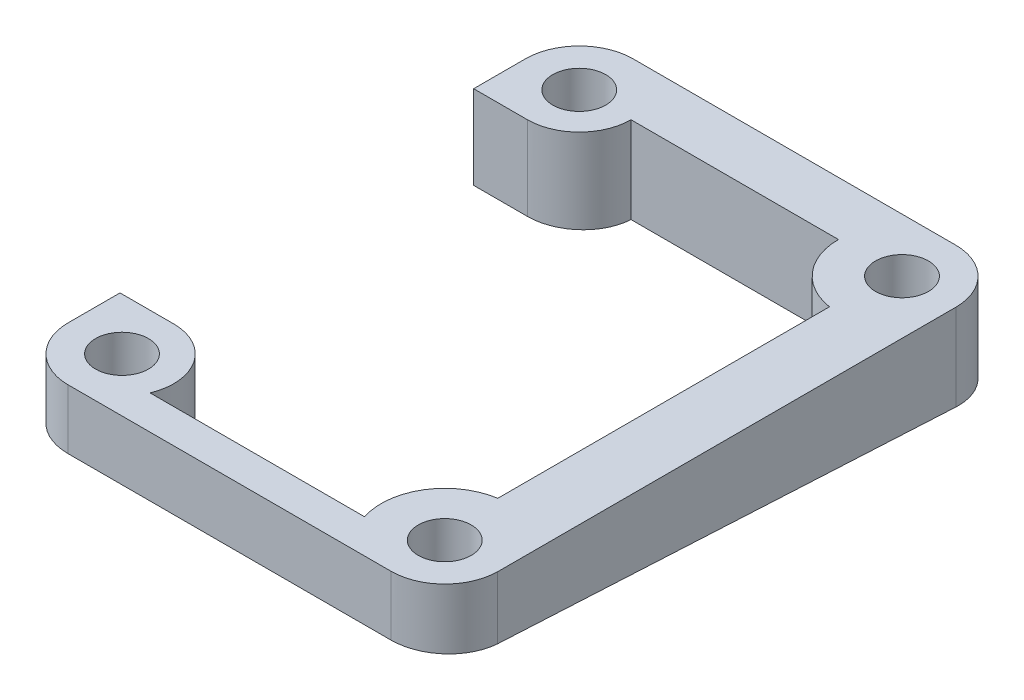
ISO-10303-21;
HEADER;
FILE_DESCRIPTION(('STEP AP214'),'2;1');
FILE_NAME('part.step','',(''),(''),'','','');
FILE_SCHEMA(('AUTOMOTIVE_DESIGN { 1 0 10303 214 1 1 1 1 }'));
ENDSEC;
DATA;
#1=APPLICATION_CONTEXT('core data for automotive mechanical design processes');
#2=APPLICATION_PROTOCOL_DEFINITION('international standard','automotive_design',2000,#1);
#3=PRODUCT_CONTEXT('',#1,'mechanical');
#4=PRODUCT('Part','Part','',(#3));
#5=PRODUCT_RELATED_PRODUCT_CATEGORY('part','',(#4));
#6=PRODUCT_DEFINITION_FORMATION('','',#4);
#7=PRODUCT_DEFINITION_CONTEXT('part definition',#1,'design');
#8=PRODUCT_DEFINITION('design','',#6,#7);
#9=PRODUCT_DEFINITION_SHAPE('','',#8);
#10=(LENGTH_UNIT() NAMED_UNIT(*) SI_UNIT(.MILLI.,.METRE.));
#11=(NAMED_UNIT(*) PLANE_ANGLE_UNIT() SI_UNIT($,.RADIAN.));
#12=(NAMED_UNIT(*) SI_UNIT($,.STERADIAN.) SOLID_ANGLE_UNIT());
#13=UNCERTAINTY_MEASURE_WITH_UNIT(LENGTH_MEASURE(1.E-05),#10,'distance_accuracy_value','');
#14=(GEOMETRIC_REPRESENTATION_CONTEXT(3) GLOBAL_UNCERTAINTY_ASSIGNED_CONTEXT((#13)) GLOBAL_UNIT_ASSIGNED_CONTEXT((#10,
#11,#12)) REPRESENTATION_CONTEXT('',''));
#15=CARTESIAN_POINT('',(0.,0.,0.));
#16=DIRECTION('',(0.,0.,1.));
#17=DIRECTION('',(1.,0.,0.));
#18=AXIS2_PLACEMENT_3D('',#15,#16,#17);
#19=CARTESIAN_POINT('',(-6326.34207077377,-2154.41168809204,-295.630515946644));
#20=DIRECTION('',(0.,1.,0.));
#21=DIRECTION('',(-1.,0.,0.));
#22=AXIS2_PLACEMENT_3D('',#19,#20,#21);
#23=CYLINDRICAL_SURFACE('',#22,1.25000000000973);
#24=CARTESIAN_POINT('',(-6326.34207077377,-2117.34312828324,-295.630515946644));
#25=DIRECTION('',(0.,-1.,0.));
#26=DIRECTION('',(1.,0.,0.));
#27=AXIS2_PLACEMENT_3D('',#24,#25,#26);
#28=CIRCLE('',#27,1.25000000000973);
#29=CARTESIAN_POINT('',(-6325.09207077376,-2117.34312828324,-295.630515946644));
#30=VERTEX_POINT('',#29);
#31=EDGE_CURVE('E195',#30,#30,#28,.T.);
#32=ORIENTED_EDGE('',*,*,#31,.F.);
#33=EDGE_LOOP('',(#32));
#34=FACE_BOUND('',#33,.T.);
#35=CARTESIAN_POINT('',(-6326.34207077377,-2120.2931522486,-295.630515946644));
#36=DIRECTION('',(0.,-0.998625843115796,0.0524063494365438));
#37=DIRECTION('',(0.,0.0524063494365438,0.998625843115796));
#38=AXIS2_PLACEMENT_3D('',#35,#36,#37);
#39=ELLIPSE('',#38,1.25172005974693,1.25000000000973);
#40=CARTESIAN_POINT('',(-6326.34207077377,-2120.22755416975,-294.380515946635));
#41=VERTEX_POINT('',#40);
#42=EDGE_CURVE('E627',#41,#41,#39,.T.);
#43=ORIENTED_EDGE('',*,*,#42,.T.);
#44=EDGE_LOOP('',(#43));
#45=FACE_BOUND('',#44,.T.);
#46=ADVANCED_FACE('F41',(#34,#45),#23,.F.);
#47=CARTESIAN_POINT('',(-6326.34207077377,-2154.41168809204,-317.220515946645));
#48=DIRECTION('',(0.,1.,0.));
#49=DIRECTION('',(-1.,0.,0.));
#50=AXIS2_PLACEMENT_3D('',#47,#48,#49);
#51=CYLINDRICAL_SURFACE('',#50,1.25000000000883);
#52=CARTESIAN_POINT('',(-6326.34207077377,-2117.34312828324,-317.220515946645));
#53=DIRECTION('',(0.,-1.,0.));
#54=DIRECTION('',(1.,0.,0.));
#55=AXIS2_PLACEMENT_3D('',#52,#53,#54);
#56=CIRCLE('',#55,1.25000000000883);
#57=CARTESIAN_POINT('',(-6325.09207077376,-2117.34312828324,-317.220515946645));
#58=VERTEX_POINT('',#57);
#59=EDGE_CURVE('E198',#58,#58,#56,.T.);
#60=ORIENTED_EDGE('',*,*,#59,.F.);
#61=EDGE_LOOP('',(#60));
#62=FACE_BOUND('',#61,.T.);
#63=CARTESIAN_POINT('',(-6326.34207077377,-2121.42616226645,-317.220515946645));
#64=DIRECTION('',(0.,-0.998625843115796,0.0524063494365438));
#65=DIRECTION('',(0.,0.0524063494365438,0.998625843115796));
#66=AXIS2_PLACEMENT_3D('',#63,#64,#65);
#67=ELLIPSE('',#66,1.25172005974603,1.25000000000883);
#68=CARTESIAN_POINT('',(-6326.34207077377,-2121.3605641876,-315.970515946636));
#69=VERTEX_POINT('',#68);
#70=EDGE_CURVE('E51',#69,#69,#67,.T.);
#71=ORIENTED_EDGE('',*,*,#70,.T.);
#72=EDGE_LOOP('',(#71));
#73=FACE_BOUND('',#72,.T.);
#74=ADVANCED_FACE('F365',(#62,#73),#51,.F.);
#75=CARTESIAN_POINT('',(-6341.58207077377,-2154.41168809204,-317.220515946644));
#76=DIRECTION('',(0.,1.,0.));
#77=DIRECTION('',(-1.,0.,0.));
#78=AXIS2_PLACEMENT_3D('',#75,#76,#77);
#79=CYLINDRICAL_SURFACE('',#78,1.25000000000891);
#80=CARTESIAN_POINT('',(-6341.58207077377,-2117.34312828324,-317.220515946644));
#81=DIRECTION('',(0.,-1.,0.));
#82=DIRECTION('',(1.,0.,0.));
#83=AXIS2_PLACEMENT_3D('',#80,#81,#82);
#84=CIRCLE('',#83,1.25000000000891);
#85=CARTESIAN_POINT('',(-6340.33207077376,-2117.34312828324,-317.220515946644));
#86=VERTEX_POINT('',#85);
#87=EDGE_CURVE('E201',#86,#86,#84,.T.);
#88=ORIENTED_EDGE('',*,*,#87,.F.);
#89=EDGE_LOOP('',(#88));
#90=FACE_BOUND('',#89,.T.);
#91=CARTESIAN_POINT('',(-6341.58207077377,-2121.42616226645,-317.220515946644));
#92=DIRECTION('',(0.,-0.998625843115796,0.0524063494365438));
#93=DIRECTION('',(0.,0.0524063494365438,0.998625843115796));
#94=AXIS2_PLACEMENT_3D('',#91,#92,#93);
#95=ELLIPSE('',#94,1.25172005974611,1.25000000000891);
#96=CARTESIAN_POINT('',(-6341.58207077377,-2121.3605641876,-315.970515946636));
#97=VERTEX_POINT('',#96);
#98=EDGE_CURVE('E11',#97,#97,#95,.T.);
#99=ORIENTED_EDGE('',*,*,#98,.T.);
#100=EDGE_LOOP('',(#99));
#101=FACE_BOUND('',#100,.T.);
#102=ADVANCED_FACE('F371',(#90,#101),#79,.F.);
#103=CARTESIAN_POINT('',(-6341.58207077376,-2154.41168809204,-295.630515946636));
#104=DIRECTION('',(0.,1.,0.));
#105=DIRECTION('',(-1.,0.,0.));
#106=AXIS2_PLACEMENT_3D('',#103,#104,#105);
#107=CYLINDRICAL_SURFACE('',#106,2.53999999999988);
#108=CARTESIAN_POINT('',(-6341.58207077376,-2120.2931522486,-295.630515946636));
#109=DIRECTION('',(0.,-0.998625843115796,0.0524063494365438));
#110=DIRECTION('',(0.,0.0524063494365438,0.998625843115796));
#111=AXIS2_PLACEMENT_3D('',#108,#109,#110);
#112=ELLIPSE('',#111,2.54349516138583,2.53999999999988);
#113=CARTESIAN_POINT('',(-6341.58207077376,-2120.15985695238,-293.090515946636));
#114=VERTEX_POINT('',#113);
#115=CARTESIAN_POINT('',(-6344.12207077376,-2120.2931522486,-295.630515946636));
#116=VERTEX_POINT('',#115);
#117=EDGE_CURVE('E107',#114,#116,#112,.T.);
#118=ORIENTED_EDGE('',*,*,#117,.F.);
#119=DIRECTION('',(0.,1.,0.));
#120=VECTOR('',#119,1.);
#121=CARTESIAN_POINT('',(-6341.58207077376,-2154.41168809204,-293.090515946636));
#122=LINE('',#121,#120);
#123=CARTESIAN_POINT('',(-6341.58207077376,-2117.34312828324,-293.090515946636));
#124=VERTEX_POINT('',#123);
#125=EDGE_CURVE('E257',#114,#124,#122,.T.);
#126=ORIENTED_EDGE('',*,*,#125,.T.);
#127=CARTESIAN_POINT('',(-6341.58207077376,-2117.34312828324,-295.630515946636));
#128=DIRECTION('',(0.,-1.,0.));
#129=DIRECTION('',(1.,0.,0.));
#130=AXIS2_PLACEMENT_3D('',#127,#128,#129);
#131=CIRCLE('',#130,2.53999999999988);
#132=CARTESIAN_POINT('',(-6344.12207077376,-2117.34312828324,-295.630515946636));
#133=VERTEX_POINT('',#132);
#134=EDGE_CURVE('E251',#124,#133,#131,.T.);
#135=ORIENTED_EDGE('',*,*,#134,.T.);
#136=DIRECTION('',(0.,1.,0.));
#137=VECTOR('',#136,1.);
#138=CARTESIAN_POINT('',(-6344.12207077376,-2154.41168809204,-295.630515946636));
#139=LINE('',#138,#137);
#140=EDGE_CURVE('E254',#116,#133,#139,.T.);
#141=ORIENTED_EDGE('',*,*,#140,.F.);
#142=EDGE_LOOP('',(#118,#126,#135,#141));
#143=FACE_BOUND('',#142,.T.);
#144=ADVANCED_FACE('F336',(#143),#107,.T.);
#145=CARTESIAN_POINT('',(-6326.34207077377,-2154.41168809204,-293.090515946645));
#146=DIRECTION('',(-5.79151774657046E-13,0.,-1.));
#147=DIRECTION('',(-1.,0.,5.79151774657046E-13));
#148=AXIS2_PLACEMENT_3D('',#145,#146,#147);
#149=PLANE('',#148);
#150=DIRECTION('',(-1.,0.,5.79151774657046E-13));
#151=VECTOR('',#150,1.);
#152=CARTESIAN_POINT('',(-6326.34207077377,-2120.15985695238,-293.090515946645));
#153=LINE('',#152,#151);
#154=CARTESIAN_POINT('',(-6326.34207077377,-2120.15985695238,-293.090515946645));
#155=VERTEX_POINT('',#154);
#156=EDGE_CURVE('E159',#155,#114,#153,.T.);
#157=ORIENTED_EDGE('',*,*,#156,.F.);
#158=DIRECTION('',(0.,1.,0.));
#159=VECTOR('',#158,1.);
#160=CARTESIAN_POINT('',(-6326.34207077377,-2154.41168809204,-293.09051594664));
#161=LINE('',#160,#159);
#162=CARTESIAN_POINT('',(-6326.34207077377,-2117.34312828324,-293.09051594664));
#163=VERTEX_POINT('',#162);
#164=EDGE_CURVE('E260',#155,#163,#161,.T.);
#165=ORIENTED_EDGE('',*,*,#164,.T.);
#166=DIRECTION('',(-1.,0.,5.79151774657046E-13));
#167=VECTOR('',#166,1.);
#168=CARTESIAN_POINT('',(-6326.34207077377,-2117.34312828324,-293.090515946645));
#169=LINE('',#168,#167);
#170=EDGE_CURVE('E248',#163,#124,#169,.T.);
#171=ORIENTED_EDGE('',*,*,#170,.T.);
#172=ORIENTED_EDGE('',*,*,#125,.F.);
#173=EDGE_LOOP('',(#157,#165,#171,#172));
#174=FACE_BOUND('',#173,.T.);
#175=ADVANCED_FACE('F387',(#174),#149,.F.);
#176=CARTESIAN_POINT('',(-6326.34207077376,-2154.41168809204,-295.630515946636));
#177=DIRECTION('',(0.,1.,0.));
#178=DIRECTION('',(-1.,0.,0.));
#179=AXIS2_PLACEMENT_3D('',#176,#177,#178);
#180=CYLINDRICAL_SURFACE('',#179,2.53999999999558);
#181=CARTESIAN_POINT('',(-6326.34207077376,-2120.2931522486,-295.630515946636));
#182=DIRECTION('',(0.,-0.998625843115796,0.0524063494365438));
#183=DIRECTION('',(0.,0.0524063494365438,0.998625843115796));
#184=AXIS2_PLACEMENT_3D('',#181,#182,#183);
#185=ELLIPSE('',#184,2.54349516138153,2.53999999999558);
#186=CARTESIAN_POINT('',(-6323.80274025592,-2120.29009202015,-295.572201958867));
#187=VERTEX_POINT('',#186);
#188=EDGE_CURVE('E102',#187,#155,#185,.T.);
#189=ORIENTED_EDGE('',*,*,#188,.F.);
#190=DIRECTION('',(0.,1.,0.));
#191=VECTOR('',#190,1.);
#192=CARTESIAN_POINT('',(-6323.80274025592,-2154.41168809204,-295.572201958867));
#193=LINE('',#192,#191);
#194=CARTESIAN_POINT('',(-6323.80274025592,-2117.34312828324,-295.572201958867));
#195=VERTEX_POINT('',#194);
#196=EDGE_CURVE('E263',#187,#195,#193,.T.);
#197=ORIENTED_EDGE('',*,*,#196,.T.);
#198=CARTESIAN_POINT('',(-6326.34207077376,-2117.34312828324,-295.630515946636));
#199=DIRECTION('',(0.,-1.,0.));
#200=DIRECTION('',(1.,0.,0.));
#201=AXIS2_PLACEMENT_3D('',#198,#199,#200);
#202=CIRCLE('',#201,2.53999999999558);
#203=EDGE_CURVE('E245',#195,#163,#202,.T.);
#204=ORIENTED_EDGE('',*,*,#203,.T.);
#205=ORIENTED_EDGE('',*,*,#164,.F.);
#206=EDGE_LOOP('',(#189,#197,#204,#205));
#207=FACE_BOUND('',#206,.T.);
#208=ADVANCED_FACE('F390',(#207),#180,.T.);
#209=CARTESIAN_POINT('',(-6323.80207077498,-2154.41168809204,-317.220437396049));
#210=DIRECTION('',(-0.999999999521809,0.,-3.09254279393959E-05));
#211=DIRECTION('',(-3.09254279393959E-05,0.,0.999999999521809));
#212=AXIS2_PLACEMENT_3D('',#209,#210,#211);
#213=PLANE('',#212);
#214=DIRECTION('',(-3.08829315497958E-05,0.0524063494115524,0.998625842639574));
#215=VECTOR('',#214,1.);
#216=CARTESIAN_POINT('',(-6323.80201738916,-2121.51675044345,-318.946713165238));
#217=LINE('',#216,#215);
#218=CARTESIAN_POINT('',(-6323.80207077498,-2121.42615814424,-317.220437396049));
#219=VERTEX_POINT('',#218);
#220=EDGE_CURVE('E98',#219,#187,#217,.T.);
#221=ORIENTED_EDGE('',*,*,#220,.F.);
#222=DIRECTION('',(0.,1.,0.));
#223=VECTOR('',#222,1.);
#224=CARTESIAN_POINT('',(-6323.80207077498,-2154.41168809204,-317.220437396049));
#225=LINE('',#224,#223);
#226=CARTESIAN_POINT('',(-6323.80207077498,-2117.34312828324,-317.220437396049));
#227=VERTEX_POINT('',#226);
#228=EDGE_CURVE('E266',#219,#227,#225,.T.);
#229=ORIENTED_EDGE('',*,*,#228,.T.);
#230=DIRECTION('',(-3.09254279393959E-05,0.,0.999999999521809));
#231=VECTOR('',#230,1.);
#232=CARTESIAN_POINT('',(-6323.80207077498,-2117.34312828324,-317.220437396049));
#233=LINE('',#232,#231);
#234=EDGE_CURVE('E242',#227,#195,#233,.T.);
#235=ORIENTED_EDGE('',*,*,#234,.T.);
#236=ORIENTED_EDGE('',*,*,#196,.F.);
#237=EDGE_LOOP('',(#221,#229,#235,#236));
#238=FACE_BOUND('',#237,.T.);
#239=ADVANCED_FACE('F394',(#238),#213,.F.);
#240=CARTESIAN_POINT('',(-6326.34207077376,-2154.41168809204,-317.220515946636));
#241=DIRECTION('',(0.,1.,0.));
#242=DIRECTION('',(-1.,0.,0.));
#243=AXIS2_PLACEMENT_3D('',#240,#241,#242);
#244=CYLINDRICAL_SURFACE('',#243,2.53999999999969);
#245=CARTESIAN_POINT('',(-6326.34207077376,-2121.42616226645,-317.220515946636));
#246=DIRECTION('',(0.,-0.998625843115796,0.0524063494365438));
#247=DIRECTION('',(0.,0.0524063494365438,0.998625843115796));
#248=AXIS2_PLACEMENT_3D('',#245,#246,#247);
#249=ELLIPSE('',#248,2.54349516138565,2.53999999999969);
#250=CARTESIAN_POINT('',(-6326.34207077376,-2121.55945756267,-319.760515946636));
#251=VERTEX_POINT('',#250);
#252=EDGE_CURVE('E171',#251,#219,#249,.T.);
#253=ORIENTED_EDGE('',*,*,#252,.F.);
#254=DIRECTION('',(0.,1.,0.));
#255=VECTOR('',#254,1.);
#256=CARTESIAN_POINT('',(-6326.34207077376,-2154.41168809204,-319.760515946636));
#257=LINE('',#256,#255);
#258=CARTESIAN_POINT('',(-6326.34207077376,-2117.34312828324,-319.760515946636));
#259=VERTEX_POINT('',#258);
#260=EDGE_CURVE('E269',#251,#259,#257,.T.);
#261=ORIENTED_EDGE('',*,*,#260,.T.);
#262=CARTESIAN_POINT('',(-6326.34207077376,-2117.34312828324,-317.220515946636));
#263=DIRECTION('',(0.,-1.,0.));
#264=DIRECTION('',(1.,0.,0.));
#265=AXIS2_PLACEMENT_3D('',#262,#263,#264);
#266=CIRCLE('',#265,2.53999999999969);
#267=EDGE_CURVE('E239',#259,#227,#266,.T.);
#268=ORIENTED_EDGE('',*,*,#267,.T.);
#269=ORIENTED_EDGE('',*,*,#228,.F.);
#270=EDGE_LOOP('',(#253,#261,#268,#269));
#271=FACE_BOUND('',#270,.T.);
#272=ADVANCED_FACE('F398',(#271),#244,.T.);
#273=CARTESIAN_POINT('',(-6341.58207077376,-2154.41168809204,-319.760515946636));
#274=DIRECTION('',(0.,0.,1.));
#275=DIRECTION('',(1.,0.,0.));
#276=AXIS2_PLACEMENT_3D('',#273,#274,#275);
#277=PLANE('',#276);
#278=DIRECTION('',(1.,0.,0.));
#279=VECTOR('',#278,1.);
#280=CARTESIAN_POINT('',(-6341.58207077376,-2121.55945756267,-319.760515946636));
#281=LINE('',#280,#279);
#282=CARTESIAN_POINT('',(-6341.58207077376,-2121.55945756267,-319.760515946636));
#283=VERTEX_POINT('',#282);
#284=EDGE_CURVE('E173',#283,#251,#281,.T.);
#285=ORIENTED_EDGE('',*,*,#284,.F.);
#286=DIRECTION('',(0.,1.,0.));
#287=VECTOR('',#286,1.);
#288=CARTESIAN_POINT('',(-6341.58207077376,-2154.41168809204,-319.760515946639));
#289=LINE('',#288,#287);
#290=CARTESIAN_POINT('',(-6341.58207077376,-2117.34312828324,-319.760515946639));
#291=VERTEX_POINT('',#290);
#292=EDGE_CURVE('E272',#283,#291,#289,.T.);
#293=ORIENTED_EDGE('',*,*,#292,.T.);
#294=DIRECTION('',(1.,0.,0.));
#295=VECTOR('',#294,1.);
#296=CARTESIAN_POINT('',(-6341.58207077376,-2117.34312828324,-319.760515946636));
#297=LINE('',#296,#295);
#298=EDGE_CURVE('E236',#291,#259,#297,.T.);
#299=ORIENTED_EDGE('',*,*,#298,.T.);
#300=ORIENTED_EDGE('',*,*,#260,.F.);
#301=EDGE_LOOP('',(#285,#293,#299,#300));
#302=FACE_BOUND('',#301,.T.);
#303=ADVANCED_FACE('F402',(#302),#277,.F.);
#304=CARTESIAN_POINT('',(-6341.58207077376,-2154.41168809204,-317.220515946636));
#305=DIRECTION('',(0.,1.,0.));
#306=DIRECTION('',(-1.,0.,0.));
#307=AXIS2_PLACEMENT_3D('',#304,#305,#306);
#308=CYLINDRICAL_SURFACE('',#307,2.54000000000343);
#309=CARTESIAN_POINT('',(-6341.58207077376,-2121.42616226645,-317.220515946636));
#310=DIRECTION('',(0.,-0.998625843115796,0.0524063494365438));
#311=DIRECTION('',(0.,0.0524063494365438,0.998625843115796));
#312=AXIS2_PLACEMENT_3D('',#309,#310,#311);
#313=ELLIPSE('',#312,2.54349516138939,2.54000000000343);
#314=CARTESIAN_POINT('',(-6344.12207077377,-2121.42616226645,-317.220515946644));
#315=VERTEX_POINT('',#314);
#316=EDGE_CURVE('E175',#315,#283,#313,.T.);
#317=ORIENTED_EDGE('',*,*,#316,.F.);
#318=DIRECTION('',(0.,1.,0.));
#319=VECTOR('',#318,1.);
#320=CARTESIAN_POINT('',(-6344.12207077377,-2154.41168809204,-317.220515946644));
#321=LINE('',#320,#319);
#322=CARTESIAN_POINT('',(-6344.12207077377,-2117.34312828324,-317.220515946644));
#323=VERTEX_POINT('',#322);
#324=EDGE_CURVE('E275',#315,#323,#321,.T.);
#325=ORIENTED_EDGE('',*,*,#324,.T.);
#326=CARTESIAN_POINT('',(-6341.58207077376,-2117.34312828324,-317.220515946636));
#327=DIRECTION('',(0.,-1.,0.));
#328=DIRECTION('',(1.,0.,0.));
#329=AXIS2_PLACEMENT_3D('',#326,#327,#328);
#330=CIRCLE('',#329,2.54000000000343);
#331=EDGE_CURVE('E233',#323,#291,#330,.T.);
#332=ORIENTED_EDGE('',*,*,#331,.T.);
#333=ORIENTED_EDGE('',*,*,#292,.F.);
#334=EDGE_LOOP('',(#317,#325,#332,#333));
#335=FACE_BOUND('',#334,.T.);
#336=ADVANCED_FACE('F406',(#335),#308,.T.);
#337=CARTESIAN_POINT('',(-6344.12207077377,-2154.41168809204,-317.220515946644));
#338=DIRECTION('',(1.,0.,-2.90610525872351E-12));
#339=DIRECTION('',(-2.90610525872351E-12,0.,-1.));
#340=AXIS2_PLACEMENT_3D('',#337,#338,#339);
#341=PLANE('',#340);
#342=DIRECTION('',(-2.90205266633982E-12,-0.0524063494365438,-0.998625843115796));
#343=VECTOR('',#342,1.);
#344=CARTESIAN_POINT('',(-6344.12207077377,-2121.51675455443,-318.946791501746));
#345=LINE('',#344,#343);
#346=CARTESIAN_POINT('',(-6344.12207077376,-2121.29785242423,-314.775515946637));
#347=VERTEX_POINT('',#346);
#348=EDGE_CURVE('E177',#347,#315,#345,.T.);
#349=ORIENTED_EDGE('',*,*,#348,.F.);
#350=DIRECTION('',(0.,1.,0.));
#351=VECTOR('',#350,1.);
#352=CARTESIAN_POINT('',(-6344.12207077376,-2154.41168809204,-314.775515946637));
#353=LINE('',#352,#351);
#354=CARTESIAN_POINT('',(-6344.12207077376,-2117.34312828324,-314.775515946637));
#355=VERTEX_POINT('',#354);
#356=EDGE_CURVE('E278',#347,#355,#353,.T.);
#357=ORIENTED_EDGE('',*,*,#356,.T.);
#358=DIRECTION('',(-2.90610525872351E-12,0.,-1.));
#359=VECTOR('',#358,1.);
#360=CARTESIAN_POINT('',(-6344.12207077377,-2117.34312828324,-317.220515946644));
#361=LINE('',#360,#359);
#362=EDGE_CURVE('E230',#355,#323,#361,.T.);
#363=ORIENTED_EDGE('',*,*,#362,.T.);
#364=ORIENTED_EDGE('',*,*,#324,.F.);
#365=EDGE_LOOP('',(#349,#357,#363,#364));
#366=FACE_BOUND('',#365,.T.);
#367=ADVANCED_FACE('F410',(#366),#341,.F.);
#368=CARTESIAN_POINT('',(-6341.58207077376,-2154.41168809204,-314.775515946637));
#369=DIRECTION('',(0.,0.,-1.));
#370=DIRECTION('',(-1.,0.,0.));
#371=AXIS2_PLACEMENT_3D('',#368,#369,#370);
#372=PLANE('',#371);
#373=DIRECTION('',(-1.,0.,0.));
#374=VECTOR('',#373,1.);
#375=CARTESIAN_POINT('',(-6341.58207077376,-2121.29785242423,-314.775515946637));
#376=LINE('',#375,#374);
#377=CARTESIAN_POINT('',(-6341.58207077376,-2121.29785242423,-314.775515946637));
#378=VERTEX_POINT('',#377);
#379=EDGE_CURVE('E179',#378,#347,#376,.T.);
#380=ORIENTED_EDGE('',*,*,#379,.F.);
#381=DIRECTION('',(0.,1.,0.));
#382=VECTOR('',#381,1.);
#383=CARTESIAN_POINT('',(-6341.58207077376,-2154.41168809204,-314.775515946637));
#384=LINE('',#383,#382);
#385=CARTESIAN_POINT('',(-6341.58207077376,-2117.34312828324,-314.775515946637));
#386=VERTEX_POINT('',#385);
#387=EDGE_CURVE('E281',#378,#386,#384,.T.);
#388=ORIENTED_EDGE('',*,*,#387,.T.);
#389=DIRECTION('',(-1.,0.,0.));
#390=VECTOR('',#389,1.);
#391=CARTESIAN_POINT('',(-6341.58207077376,-2117.34312828324,-314.775515946637));
#392=LINE('',#391,#390);
#393=EDGE_CURVE('E227',#386,#355,#392,.T.);
#394=ORIENTED_EDGE('',*,*,#393,.T.);
#395=ORIENTED_EDGE('',*,*,#356,.F.);
#396=EDGE_LOOP('',(#380,#388,#394,#395));
#397=FACE_BOUND('',#396,.T.);
#398=ADVANCED_FACE('F414',(#397),#372,.F.);
#399=CARTESIAN_POINT('',(-6341.58207077376,-2154.41168809204,-317.220515946636));
#400=DIRECTION('',(0.,1.,0.));
#401=DIRECTION('',(-1.,0.,0.));
#402=AXIS2_PLACEMENT_3D('',#399,#400,#401);
#403=CYLINDRICAL_SURFACE('',#402,2.44499999999903);
#404=CARTESIAN_POINT('',(-6341.58207077376,-2121.42616226645,-317.220515946636));
#405=DIRECTION('',(0.,-0.998625843115796,0.0524063494365438));
#406=DIRECTION('',(0.,0.0524063494365438,0.998625843115796));
#407=AXIS2_PLACEMENT_3D('',#404,#405,#406);
#408=ELLIPSE('',#407,2.44836443684496,2.44499999999903);
#409=CARTESIAN_POINT('',(-6339.13707077493,-2121.42615829842,-317.220440333965));
#410=VERTEX_POINT('',#409);
#411=EDGE_CURVE('E181',#410,#378,#408,.T.);
#412=ORIENTED_EDGE('',*,*,#411,.F.);
#413=DIRECTION('',(0.,1.,0.));
#414=VECTOR('',#413,1.);
#415=CARTESIAN_POINT('',(-6339.13707077493,-2154.41168809204,-317.220440333965));
#416=LINE('',#415,#414);
#417=CARTESIAN_POINT('',(-6339.13707077493,-2117.34312828324,-317.220440333965));
#418=VERTEX_POINT('',#417);
#419=EDGE_CURVE('E284',#410,#418,#416,.T.);
#420=ORIENTED_EDGE('',*,*,#419,.T.);
#421=CARTESIAN_POINT('',(-6341.58207077376,-2117.34312828324,-317.220515946636));
#422=DIRECTION('',(0.,-1.,0.));
#423=DIRECTION('',(1.,0.,0.));
#424=AXIS2_PLACEMENT_3D('',#421,#422,#423);
#425=CIRCLE('',#424,2.44499999999903);
#426=EDGE_CURVE('E224',#418,#386,#425,.T.);
#427=ORIENTED_EDGE('',*,*,#426,.T.);
#428=ORIENTED_EDGE('',*,*,#387,.F.);
#429=EDGE_LOOP('',(#412,#420,#427,#428));
#430=FACE_BOUND('',#429,.T.);
#431=ADVANCED_FACE('F312',(#430),#403,.T.);
#432=CARTESIAN_POINT('',(-6329.34207074988,-2154.41168809204,-317.220137419397));
#433=DIRECTION('',(3.09254279007452E-05,0.,-0.999999999521809));
#434=DIRECTION('',(-0.999999999521809,0.,-3.09254279007452E-05));
#435=AXIS2_PLACEMENT_3D('',#432,#433,#434);
#436=PLANE('',#435);
#437=DIRECTION('',(-0.999999999520492,-1.62291892740533E-06,-3.09254279007045E-05));
#438=VECTOR('',#437,1.);
#439=CARTESIAN_POINT('',(-6329.34212428275,-2121.42614240201,-317.220137421053));
#440=LINE('',#439,#438);
#441=CARTESIAN_POINT('',(-6329.34207074988,-2121.42614240192,-317.220137419397));
#442=VERTEX_POINT('',#441);
#443=EDGE_CURVE('E183',#442,#410,#440,.T.);
#444=ORIENTED_EDGE('',*,*,#443,.F.);
#445=DIRECTION('',(0.,1.,0.));
#446=VECTOR('',#445,1.);
#447=CARTESIAN_POINT('',(-6329.34207074988,-2154.41168809204,-317.220137419397));
#448=LINE('',#447,#446);
#449=CARTESIAN_POINT('',(-6329.34207074988,-2117.34312828324,-317.220137419397));
#450=VERTEX_POINT('',#449);
#451=EDGE_CURVE('E149',#442,#450,#448,.T.);
#452=ORIENTED_EDGE('',*,*,#451,.T.);
#453=DIRECTION('',(-0.999999999521809,0.,-3.09254279007452E-05));
#454=VECTOR('',#453,1.);
#455=CARTESIAN_POINT('',(-6329.34207074988,-2117.34312828324,-317.220137419397));
#456=LINE('',#455,#454);
#457=EDGE_CURVE('E221',#450,#418,#456,.T.);
#458=ORIENTED_EDGE('',*,*,#457,.T.);
#459=ORIENTED_EDGE('',*,*,#419,.F.);
#460=EDGE_LOOP('',(#444,#452,#458,#459));
#461=FACE_BOUND('',#460,.T.);
#462=ADVANCED_FACE('F291',(#461),#436,.F.);
#463=CARTESIAN_POINT('',(-6326.34207077376,-2154.41168809204,-317.220515946636));
#464=DIRECTION('',(0.,1.,0.));
#465=DIRECTION('',(-1.,0.,0.));
#466=AXIS2_PLACEMENT_3D('',#463,#464,#465);
#467=CYLINDRICAL_SURFACE('',#466,3.00000000000007);
#468=CARTESIAN_POINT('',(-6326.34207077376,-2121.42616226645,-317.220515946636));
#469=DIRECTION('',(0.,-0.998625843115796,0.0524063494365438));
#470=DIRECTION('',(0.,0.0524063494365438,0.998625843115796));
#471=AXIS2_PLACEMENT_3D('',#468,#469,#470);
#472=ELLIPSE('',#471,3.00412814336931,3.00000000000007);
#473=CARTESIAN_POINT('',(-6326.8021624527,-2121.27058937233,-314.256006603259));
#474=VERTEX_POINT('',#473);
#475=EDGE_CURVE('E139',#474,#442,#472,.T.);
#476=ORIENTED_EDGE('',*,*,#475,.F.);
#477=DIRECTION('',(0.,1.,0.));
#478=VECTOR('',#477,1.);
#479=CARTESIAN_POINT('',(-6326.8021624527,-2154.41168809204,-314.256006603259));
#480=LINE('',#479,#478);
#481=CARTESIAN_POINT('',(-6326.8021624527,-2117.34312828324,-314.256006603259));
#482=VERTEX_POINT('',#481);
#483=EDGE_CURVE('E138',#474,#482,#480,.T.);
#484=ORIENTED_EDGE('',*,*,#483,.T.);
#485=CARTESIAN_POINT('',(-6326.34207077376,-2117.34312828324,-317.220515946636));
#486=DIRECTION('',(0.,-1.,0.));
#487=DIRECTION('',(1.,0.,0.));
#488=AXIS2_PLACEMENT_3D('',#485,#486,#487);
#489=CIRCLE('',#488,3.00000000000007);
#490=EDGE_CURVE('E218',#482,#450,#489,.T.);
#491=ORIENTED_EDGE('',*,*,#490,.T.);
#492=ORIENTED_EDGE('',*,*,#451,.F.);
#493=EDGE_LOOP('',(#476,#484,#491,#492));
#494=FACE_BOUND('',#493,.T.);
#495=ADVANCED_FACE('F300',(#494),#467,.T.);
#496=CARTESIAN_POINT('',(-6326.80264677758,-2154.41168809204,-298.594950082303));
#497=DIRECTION('',(0.999999999521809,0.,3.09254278948737E-05));
#498=DIRECTION('',(3.09254278948737E-05,0.,-0.999999999521809));
#499=AXIS2_PLACEMENT_3D('',#496,#497,#498);
#500=PLANE('',#499);
#501=DIRECTION('',(3.08829315053348E-05,-0.0524063494115524,-0.998625842639574));
#502=VECTOR('',#501,1.);
#503=CARTESIAN_POINT('',(-6326.80259180982,-2120.54199795287,-300.37237936403));
#504=LINE('',#503,#502);
#505=CARTESIAN_POINT('',(-6326.80264677758,-2120.44872119594,-298.594950082305));
#506=VERTEX_POINT('',#505);
#507=EDGE_CURVE('E122',#506,#474,#504,.T.);
#508=ORIENTED_EDGE('',*,*,#507,.F.);
#509=DIRECTION('',(0.,1.,0.));
#510=VECTOR('',#509,1.);
#511=CARTESIAN_POINT('',(-6326.80264677758,-2154.41168809204,-298.594950082305));
#512=LINE('',#511,#510);
#513=CARTESIAN_POINT('',(-6326.80264677758,-2117.34312828324,-298.594950082305));
#514=VERTEX_POINT('',#513);
#515=EDGE_CURVE('E135',#506,#514,#512,.T.);
#516=ORIENTED_EDGE('',*,*,#515,.T.);
#517=DIRECTION('',(3.09254278948737E-05,0.,-0.999999999521809));
#518=VECTOR('',#517,1.);
#519=CARTESIAN_POINT('',(-6326.80264677758,-2117.34312828324,-298.594950082303));
#520=LINE('',#519,#518);
#521=EDGE_CURVE('E216',#514,#482,#520,.T.);
#522=ORIENTED_EDGE('',*,*,#521,.T.);
#523=ORIENTED_EDGE('',*,*,#483,.F.);
#524=EDGE_LOOP('',(#508,#516,#522,#523));
#525=FACE_BOUND('',#524,.T.);
#526=ADVANCED_FACE('F132',(#525),#500,.F.);
#527=CARTESIAN_POINT('',(-6326.34207077376,-2154.41168809204,-295.630515946636));
#528=DIRECTION('',(0.,1.,0.));
#529=DIRECTION('',(-1.,0.,0.));
#530=AXIS2_PLACEMENT_3D('',#527,#528,#529);
#531=CYLINDRICAL_SURFACE('',#530,3.00000000000175);
#532=CARTESIAN_POINT('',(-6326.34207077376,-2120.2931522486,-295.630515946636));
#533=DIRECTION('',(0.,-0.998625843115796,0.0524063494365438));
#534=DIRECTION('',(0.,0.0524063494365438,0.998625843115796));
#535=AXIS2_PLACEMENT_3D('',#532,#533,#534);
#536=ELLIPSE('',#535,3.00412814337099,3.00000000000175);
#537=CARTESIAN_POINT('',(-6329.19244757946,-2120.24405326658,-294.694913431928));
#538=VERTEX_POINT('',#537);
#539=EDGE_CURVE('E119',#538,#506,#536,.T.);
#540=ORIENTED_EDGE('',*,*,#539,.F.);
#541=DIRECTION('',(0.,1.,0.));
#542=VECTOR('',#541,1.);
#543=CARTESIAN_POINT('',(-6329.19244757946,-2154.41168809204,-294.694913431928));
#544=LINE('',#543,#542);
#545=CARTESIAN_POINT('',(-6329.19244757946,-2117.34312828324,-294.694913431928));
#546=VERTEX_POINT('',#545);
#547=EDGE_CURVE('E145',#538,#546,#544,.T.);
#548=ORIENTED_EDGE('',*,*,#547,.T.);
#549=CARTESIAN_POINT('',(-6326.34207077376,-2117.34312828324,-295.630515946636));
#550=DIRECTION('',(0.,-1.,0.));
#551=DIRECTION('',(1.,0.,0.));
#552=AXIS2_PLACEMENT_3D('',#549,#550,#551);
#553=CIRCLE('',#552,3.00000000000175);
#554=EDGE_CURVE('E143',#546,#514,#553,.T.);
#555=ORIENTED_EDGE('',*,*,#554,.T.);
#556=ORIENTED_EDGE('',*,*,#515,.F.);
#557=EDGE_LOOP('',(#540,#548,#555,#556));
#558=FACE_BOUND('',#557,.T.);
#559=ADVANCED_FACE('F141',(#558),#531,.T.);
#560=CARTESIAN_POINT('',(-6339.32316109553,-2154.41168809204,-294.694913431928));
#561=DIRECTION('',(0.,0.,1.));
#562=DIRECTION('',(0.,-1.,0.));
#563=AXIS2_PLACEMENT_3D('',#560,#561,#562);
#564=PLANE('',#563);
#565=DIRECTION('',(1.,0.,0.));
#566=VECTOR('',#565,1.);
#567=CARTESIAN_POINT('',(-6339.32316109553,-2120.24405326658,-294.694913431928));
#568=LINE('',#567,#566);
#569=CARTESIAN_POINT('',(-6339.32316109552,-2120.24405326658,-294.694913431928));
#570=VERTEX_POINT('',#569);
#571=EDGE_CURVE('E117',#570,#538,#568,.T.);
#572=ORIENTED_EDGE('',*,*,#571,.F.);
#573=DIRECTION('',(0.,1.,0.));
#574=VECTOR('',#573,1.);
#575=CARTESIAN_POINT('',(-6339.32316109552,-2154.41168809204,-294.694913431924));
#576=LINE('',#575,#574);
#577=CARTESIAN_POINT('',(-6339.32316109552,-2117.34312828324,-294.694913431924));
#578=VERTEX_POINT('',#577);
#579=EDGE_CURVE('E147',#570,#578,#576,.T.);
#580=ORIENTED_EDGE('',*,*,#579,.T.);
#581=DIRECTION('',(1.,0.,0.));
#582=VECTOR('',#581,1.);
#583=CARTESIAN_POINT('',(-6339.32316109553,-2117.34312828324,-294.694913431928));
#584=LINE('',#583,#582);
#585=EDGE_CURVE('E212',#578,#546,#584,.T.);
#586=ORIENTED_EDGE('',*,*,#585,.T.);
#587=ORIENTED_EDGE('',*,*,#547,.F.);
#588=EDGE_LOOP('',(#572,#580,#586,#587));
#589=FACE_BOUND('',#588,.T.);
#590=ADVANCED_FACE('F354',(#589),#564,.F.);
#591=CARTESIAN_POINT('',(-6341.58207077376,-2154.41168809204,-295.630515946636));
#592=DIRECTION('',(0.,1.,0.));
#593=DIRECTION('',(-1.,0.,0.));
#594=AXIS2_PLACEMENT_3D('',#591,#592,#593);
#595=CYLINDRICAL_SURFACE('',#594,2.44499999999887);
#596=CARTESIAN_POINT('',(-6341.58207077376,-2120.2931522486,-295.630515946636));
#597=DIRECTION('',(0.,-0.998625843115796,0.0524063494365438));
#598=DIRECTION('',(0.,0.0524063494365438,0.998625843115796));
#599=AXIS2_PLACEMENT_3D('',#596,#597,#598);
#600=ELLIPSE('',#599,2.4483644368448,2.44499999999887);
#601=CARTESIAN_POINT('',(-6341.58207077377,-2120.42146209083,-298.075515946644));
#602=VERTEX_POINT('',#601);
#603=EDGE_CURVE('E187',#602,#570,#600,.T.);
#604=ORIENTED_EDGE('',*,*,#603,.F.);
#605=DIRECTION('',(0.,1.,0.));
#606=VECTOR('',#605,1.);
#607=CARTESIAN_POINT('',(-6341.58207077377,-2154.41168809204,-298.075515946644));
#608=LINE('',#607,#606);
#609=CARTESIAN_POINT('',(-6341.58207077377,-2117.34312828324,-298.075515946644));
#610=VERTEX_POINT('',#609);
#611=EDGE_CURVE('E155',#602,#610,#608,.T.);
#612=ORIENTED_EDGE('',*,*,#611,.T.);
#613=CARTESIAN_POINT('',(-6341.58207077376,-2117.34312828324,-295.630515946636));
#614=DIRECTION('',(0.,-1.,0.));
#615=DIRECTION('',(1.,0.,0.));
#616=AXIS2_PLACEMENT_3D('',#613,#614,#615);
#617=CIRCLE('',#616,2.44499999999887);
#618=EDGE_CURVE('E209',#610,#578,#617,.T.);
#619=ORIENTED_EDGE('',*,*,#618,.T.);
#620=ORIENTED_EDGE('',*,*,#579,.F.);
#621=EDGE_LOOP('',(#604,#612,#619,#620));
#622=FACE_BOUND('',#621,.T.);
#623=ADVANCED_FACE('F356',(#622),#595,.T.);
#624=CARTESIAN_POINT('',(-6344.12207077377,-2154.41168809204,-298.075515946644));
#625=DIRECTION('',(0.,0.,1.));
#626=DIRECTION('',(1.,0.,0.));
#627=AXIS2_PLACEMENT_3D('',#624,#625,#626);
#628=PLANE('',#627);
#629=DIRECTION('',(1.,0.,0.));
#630=VECTOR('',#629,1.);
#631=CARTESIAN_POINT('',(-6344.12207077377,-2120.42146209083,-298.075515946644));
#632=LINE('',#631,#630);
#633=CARTESIAN_POINT('',(-6344.12207077377,-2120.42146209083,-298.075515946644));
#634=VERTEX_POINT('',#633);
#635=EDGE_CURVE('E189',#634,#602,#632,.T.);
#636=ORIENTED_EDGE('',*,*,#635,.F.);
#637=DIRECTION('',(0.,1.,0.));
#638=VECTOR('',#637,1.);
#639=CARTESIAN_POINT('',(-6344.12207077377,-2154.41168809204,-298.075515946644));
#640=LINE('',#639,#638);
#641=CARTESIAN_POINT('',(-6344.12207077377,-2117.34312828324,-298.075515946644));
#642=VERTEX_POINT('',#641);
#643=EDGE_CURVE('E157',#634,#642,#640,.T.);
#644=ORIENTED_EDGE('',*,*,#643,.T.);
#645=DIRECTION('',(1.,0.,0.));
#646=VECTOR('',#645,1.);
#647=CARTESIAN_POINT('',(-6344.12207077377,-2117.34312828324,-298.075515946644));
#648=LINE('',#647,#646);
#649=EDGE_CURVE('E207',#642,#610,#648,.T.);
#650=ORIENTED_EDGE('',*,*,#649,.T.);
#651=ORIENTED_EDGE('',*,*,#611,.F.);
#652=EDGE_LOOP('',(#636,#644,#650,#651));
#653=FACE_BOUND('',#652,.T.);
#654=ADVANCED_FACE('F343',(#653),#628,.F.);
#655=CARTESIAN_POINT('',(-6344.12207077376,-2154.41168809204,-295.630515946636));
#656=DIRECTION('',(1.,0.,-2.90610525872285E-12));
#657=DIRECTION('',(-2.90610525872285E-12,0.,-1.));
#658=AXIS2_PLACEMENT_3D('',#655,#656,#657);
#659=PLANE('',#658);
#660=DIRECTION('',(-2.90205266633916E-12,-0.0524063494365438,-0.998625843115796));
#661=VECTOR('',#660,1.);
#662=CARTESIAN_POINT('',(-6344.12207077377,-2120.38685626414,-297.416086827446));
#663=LINE('',#662,#661);
#664=EDGE_CURVE('E60',#116,#634,#663,.T.);
#665=ORIENTED_EDGE('',*,*,#664,.F.);
#666=ORIENTED_EDGE('',*,*,#140,.T.);
#667=DIRECTION('',(-2.90610525872285E-12,0.,-1.));
#668=VECTOR('',#667,1.);
#669=CARTESIAN_POINT('',(-6344.12207077376,-2117.34312828324,-295.630515946636));
#670=LINE('',#669,#668);
#671=EDGE_CURVE('E204',#133,#642,#670,.T.);
#672=ORIENTED_EDGE('',*,*,#671,.T.);
#673=ORIENTED_EDGE('',*,*,#643,.F.);
#674=EDGE_LOOP('',(#665,#666,#672,#673));
#675=FACE_BOUND('',#674,.T.);
#676=ADVANCED_FACE('F43',(#675),#659,.F.);
#677=CARTESIAN_POINT('',(-6341.58207077376,-2117.34312828324,-295.630515946636));
#678=DIRECTION('',(0.,-1.,0.));
#679=DIRECTION('',(1.,0.,0.));
#680=AXIS2_PLACEMENT_3D('',#677,#678,#679);
#681=PLANE('',#680);
#682=ORIENTED_EDGE('',*,*,#671,.F.);
#683=ORIENTED_EDGE('',*,*,#134,.F.);
#684=ORIENTED_EDGE('',*,*,#170,.F.);
#685=ORIENTED_EDGE('',*,*,#203,.F.);
#686=ORIENTED_EDGE('',*,*,#234,.F.);
#687=ORIENTED_EDGE('',*,*,#267,.F.);
#688=ORIENTED_EDGE('',*,*,#298,.F.);
#689=ORIENTED_EDGE('',*,*,#331,.F.);
#690=ORIENTED_EDGE('',*,*,#362,.F.);
#691=ORIENTED_EDGE('',*,*,#393,.F.);
#692=ORIENTED_EDGE('',*,*,#426,.F.);
#693=ORIENTED_EDGE('',*,*,#457,.F.);
#694=ORIENTED_EDGE('',*,*,#490,.F.);
#695=ORIENTED_EDGE('',*,*,#521,.F.);
#696=ORIENTED_EDGE('',*,*,#554,.F.);
#697=ORIENTED_EDGE('',*,*,#585,.F.);
#698=ORIENTED_EDGE('',*,*,#618,.F.);
#699=ORIENTED_EDGE('',*,*,#649,.F.);
#700=EDGE_LOOP('',(#682,#683,#684,#685,#686,#687,#688,#689,#690,#691,#692,#693,#694,#695,#696,
#697,#698,#699));
#701=FACE_BOUND('',#700,.T.);
#702=ORIENTED_EDGE('',*,*,#87,.T.);
#703=EDGE_LOOP('',(#702));
#704=FACE_BOUND('',#703,.T.);
#705=ORIENTED_EDGE('',*,*,#59,.T.);
#706=EDGE_LOOP('',(#705));
#707=FACE_BOUND('',#706,.T.);
#708=ORIENTED_EDGE('',*,*,#31,.T.);
#709=EDGE_LOOP('',(#708));
#710=FACE_BOUND('',#709,.T.);
#711=CARTESIAN_POINT('',(-6341.58207077377,-2117.34312828324,-295.630515946644));
#712=DIRECTION('',(0.,-1.,0.));
#713=DIRECTION('',(1.,0.,0.));
#714=AXIS2_PLACEMENT_3D('',#711,#712,#713);
#715=CIRCLE('',#714,1.25000000000797);
#716=CARTESIAN_POINT('',(-6340.33207077376,-2117.34312828324,-295.630515946644));
#717=VERTEX_POINT('',#716);
#718=EDGE_CURVE('E192',#717,#717,#715,.T.);
#719=ORIENTED_EDGE('',*,*,#718,.T.);
#720=EDGE_LOOP('',(#719));
#721=FACE_BOUND('',#720,.T.);
#722=ADVANCED_FACE('F303',(#701,#704,#707,#710,#721),#681,.F.);
#723=CARTESIAN_POINT('',(-6341.58207077377,-2154.41168809204,-295.630515946644));
#724=DIRECTION('',(0.,1.,0.));
#725=DIRECTION('',(-1.,0.,0.));
#726=AXIS2_PLACEMENT_3D('',#723,#724,#725);
#727=CYLINDRICAL_SURFACE('',#726,1.25000000000797);
#728=ORIENTED_EDGE('',*,*,#718,.F.);
#729=EDGE_LOOP('',(#728));
#730=FACE_BOUND('',#729,.T.);
#731=CARTESIAN_POINT('',(-6341.58207077377,-2120.2931522486,-295.630515946644));
#732=DIRECTION('',(0.,-0.998625843115796,0.0524063494365438));
#733=DIRECTION('',(0.,0.0524063494365438,0.998625843115796));
#734=AXIS2_PLACEMENT_3D('',#731,#732,#733);
#735=ELLIPSE('',#734,1.25172005974516,1.25000000000797);
#736=CARTESIAN_POINT('',(-6341.58207077377,-2120.22755416975,-294.380515946636));
#737=VERTEX_POINT('',#736);
#738=EDGE_CURVE('E45',#737,#737,#735,.T.);
#739=ORIENTED_EDGE('',*,*,#738,.T.);
#740=EDGE_LOOP('',(#739));
#741=FACE_BOUND('',#740,.T.);
#742=ADVANCED_FACE('F377',(#730,#741),#727,.F.);
#743=CARTESIAN_POINT('',(-6463.83106381206,-2109.98501321345,-99.2044312143807));
#744=DIRECTION('',(0.,-0.998625843115796,0.0524063494365438));
#745=DIRECTION('',(0.,-0.0524063494365438,-0.998625843115796));
#746=AXIS2_PLACEMENT_3D('',#743,#744,#745);
#747=PLANE('',#746);
#748=ORIENTED_EDGE('',*,*,#738,.F.);
#749=EDGE_LOOP('',(#748));
#750=FACE_BOUND('',#749,.T.);
#751=ORIENTED_EDGE('',*,*,#42,.F.);
#752=EDGE_LOOP('',(#751));
#753=FACE_BOUND('',#752,.T.);
#754=ORIENTED_EDGE('',*,*,#70,.F.);
#755=EDGE_LOOP('',(#754));
#756=FACE_BOUND('',#755,.T.);
#757=ORIENTED_EDGE('',*,*,#98,.F.);
#758=EDGE_LOOP('',(#757));
#759=FACE_BOUND('',#758,.T.);
#760=ORIENTED_EDGE('',*,*,#664,.T.);
#761=ORIENTED_EDGE('',*,*,#635,.T.);
#762=ORIENTED_EDGE('',*,*,#603,.T.);
#763=ORIENTED_EDGE('',*,*,#571,.T.);
#764=ORIENTED_EDGE('',*,*,#539,.T.);
#765=ORIENTED_EDGE('',*,*,#507,.T.);
#766=ORIENTED_EDGE('',*,*,#475,.T.);
#767=ORIENTED_EDGE('',*,*,#443,.T.);
#768=ORIENTED_EDGE('',*,*,#411,.T.);
#769=ORIENTED_EDGE('',*,*,#379,.T.);
#770=ORIENTED_EDGE('',*,*,#348,.T.);
#771=ORIENTED_EDGE('',*,*,#316,.T.);
#772=ORIENTED_EDGE('',*,*,#284,.T.);
#773=ORIENTED_EDGE('',*,*,#252,.T.);
#774=ORIENTED_EDGE('',*,*,#220,.T.);
#775=ORIENTED_EDGE('',*,*,#188,.T.);
#776=ORIENTED_EDGE('',*,*,#156,.T.);
#777=ORIENTED_EDGE('',*,*,#117,.T.);
#778=EDGE_LOOP('',(#760,#761,#762,#763,#764,#765,#766,#767,#768,#769,#770,#771,#772,#773,#774,
#775,#776,#777));
#779=FACE_BOUND('',#778,.T.);
#780=ADVANCED_FACE('F121',(#750,#753,#756,#759,#779),#747,.T.);
#781=CLOSED_SHELL('',(#46,#74,#102,#144,#175,#208,#239,#272,#303,#336,#367,#398,#431,#462,#495,
#526,#559,#590,#623,#654,#676,#722,#742,#780));
#782=MANIFOLD_SOLID_BREP('B2',#781);
#783=ADVANCED_BREP_SHAPE_REPRESENTATION('',(#18,#782),#14);
#784=SHAPE_DEFINITION_REPRESENTATION(#9,#783);
ENDSEC;
END-ISO-10303-21;
